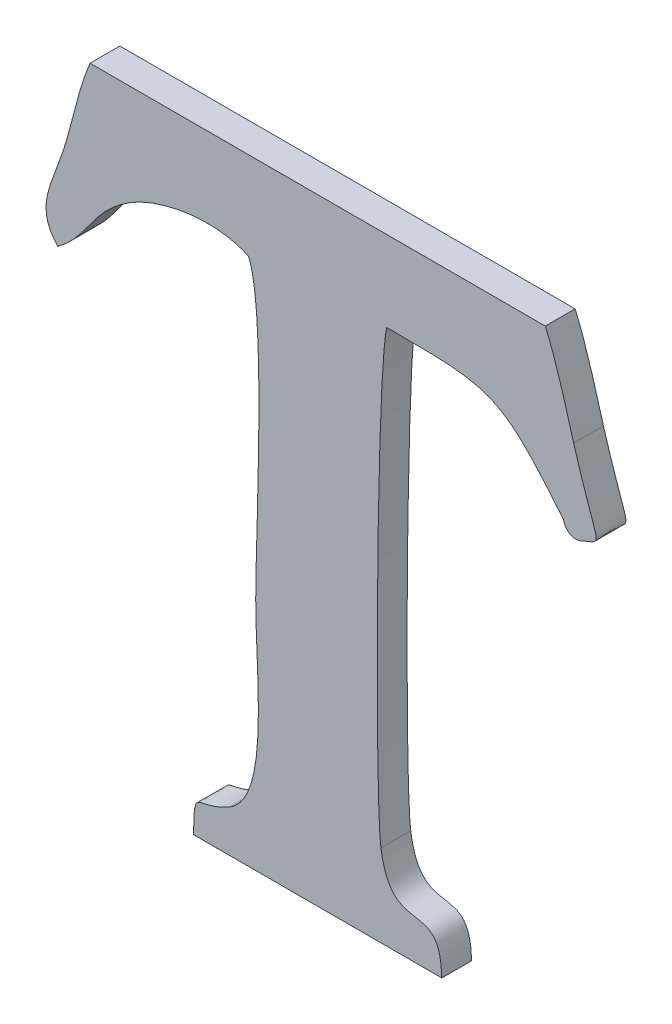
ISO-10303-21;
HEADER;
FILE_DESCRIPTION(('STEP AP214'),'2;1');
FILE_NAME('part.step','',(''),(''),'','','');
FILE_SCHEMA(('AUTOMOTIVE_DESIGN { 1 0 10303 214 1 1 1 1 }'));
ENDSEC;
DATA;
#1=APPLICATION_CONTEXT('core data for automotive mechanical design processes');
#2=APPLICATION_PROTOCOL_DEFINITION('international standard','automotive_design',2000,#1);
#3=PRODUCT_CONTEXT('',#1,'mechanical');
#4=PRODUCT('Part','Part','',(#3));
#5=PRODUCT_RELATED_PRODUCT_CATEGORY('part','',(#4));
#6=PRODUCT_DEFINITION_FORMATION('','',#4);
#7=PRODUCT_DEFINITION_CONTEXT('part definition',#1,'design');
#8=PRODUCT_DEFINITION('design','',#6,#7);
#9=PRODUCT_DEFINITION_SHAPE('','',#8);
#10=(LENGTH_UNIT() NAMED_UNIT(*) SI_UNIT(.MILLI.,.METRE.));
#11=(NAMED_UNIT(*) PLANE_ANGLE_UNIT() SI_UNIT($,.RADIAN.));
#12=(NAMED_UNIT(*) SI_UNIT($,.STERADIAN.) SOLID_ANGLE_UNIT());
#13=UNCERTAINTY_MEASURE_WITH_UNIT(LENGTH_MEASURE(1.E-05),#10,'distance_accuracy_value','');
#14=(GEOMETRIC_REPRESENTATION_CONTEXT(3) GLOBAL_UNCERTAINTY_ASSIGNED_CONTEXT((#13)) GLOBAL_UNIT_ASSIGNED_CONTEXT((#10,
#11,#12)) REPRESENTATION_CONTEXT('',''));
#15=CARTESIAN_POINT('',(0.,0.,0.));
#16=DIRECTION('',(0.,0.,1.));
#17=DIRECTION('',(1.,0.,0.));
#18=AXIS2_PLACEMENT_3D('',#15,#16,#17);
#19=CARTESIAN_POINT('',(50.1670499999998,11.219925,0.001));
#20=CARTESIAN_POINT('',(50.1670499999998,11.219925,0.));
#21=CARTESIAN_POINT('',(50.1666579999998,11.219015,0.001));
#22=CARTESIAN_POINT('',(50.1666579999998,11.219015,0.));
#23=CARTESIAN_POINT('',(50.1664759999998,11.217951,0.001));
#24=CARTESIAN_POINT('',(50.1664759999998,11.217951,0.));
#25=CARTESIAN_POINT('',(50.1661539999998,11.216943,0.001));
#26=CARTESIAN_POINT('',(50.1661539999998,11.216943,0.));
#27=B_SPLINE_SURFACE_WITH_KNOTS('',3,1,((#19,#20),(#21,#22),(#23,#24),(#25,#26)),.UNSPECIFIED.,
.F.,.F.,.F.,(4,4),(2,2),(0.8125,0.875),(0.,1.),.UNSPECIFIED.);
#28=CARTESIAN_POINT('',(50.1670499999998,11.219925,0.));
#29=CARTESIAN_POINT('',(50.1666579999998,11.219015,0.));
#30=CARTESIAN_POINT('',(50.1664759999998,11.217951,0.));
#31=CARTESIAN_POINT('',(50.1661539999998,11.216943,0.));
#32=B_SPLINE_CURVE_WITH_KNOTS('',3,(#28,#29,#30,#31),.UNSPECIFIED.,.F.,.F.,(4,4),(0.8125,0.875),.UNSPECIFIED.);
#33=CARTESIAN_POINT('',(50.1670499999998,11.219925,0.));
#34=VERTEX_POINT('',#33);
#35=CARTESIAN_POINT('',(50.1661539999998,11.216943,0.));
#36=VERTEX_POINT('',#35);
#37=EDGE_CURVE('E11',#34,#36,#32,.T.);
#38=DIRECTION('',(0.,0.,-1.));
#39=VECTOR('',#38,1.);
#40=CARTESIAN_POINT('',(50.1661539999998,11.216943,0.001));
#41=LINE('',#40,#39);
#42=CARTESIAN_POINT('',(50.1661539999998,11.216943,0.001));
#43=VERTEX_POINT('',#42);
#44=EDGE_CURVE('E28',#43,#36,#41,.T.);
#45=CARTESIAN_POINT('',(50.1670499999998,11.219925,0.001));
#46=CARTESIAN_POINT('',(50.1666579999998,11.219015,0.001));
#47=CARTESIAN_POINT('',(50.1664759999998,11.217951,0.001));
#48=CARTESIAN_POINT('',(50.1661539999998,11.216943,0.001));
#49=B_SPLINE_CURVE_WITH_KNOTS('',3,(#45,#46,#47,#48),.UNSPECIFIED.,.F.,.F.,(4,4),(0.8125,0.875),.UNSPECIFIED.);
#50=CARTESIAN_POINT('',(50.1670499999998,11.219925,0.001));
#51=VERTEX_POINT('',#50);
#52=EDGE_CURVE('E356',#51,#43,#49,.T.);
#53=DIRECTION('',(0.,0.,-1.));
#54=VECTOR('',#53,1.);
#55=CARTESIAN_POINT('',(50.1670499999998,11.219925,0.001));
#56=LINE('',#55,#54);
#57=EDGE_CURVE('E40',#51,#34,#56,.T.);
#58=ORIENTED_EDGE('',*,*,#37,.T.);
#59=ORIENTED_EDGE('',*,*,#44,.F.);
#60=ORIENTED_EDGE('',*,*,#52,.F.);
#61=ORIENTED_EDGE('',*,*,#57,.T.);
#62=EDGE_LOOP('',(#58,#59,#60,#61));
#63=FACE_BOUND('',#62,.T.);
#64=ADVANCED_FACE('F17',(#63),#27,.F.);
#65=CARTESIAN_POINT('',(50.1661539999998,11.216943,0.001));
#66=CARTESIAN_POINT('',(50.1661539999998,11.216943,0.));
#67=CARTESIAN_POINT('',(50.1657619999998,11.215753,0.001));
#68=CARTESIAN_POINT('',(50.1657619999998,11.215753,0.));
#69=CARTESIAN_POINT('',(50.1651739999998,11.214899,0.001));
#70=CARTESIAN_POINT('',(50.1651739999998,11.214899,0.));
#71=CARTESIAN_POINT('',(50.1659719999998,11.214059,0.001));
#72=CARTESIAN_POINT('',(50.1659719999998,11.214059,0.));
#73=B_SPLINE_SURFACE_WITH_KNOTS('',3,1,((#65,#66),(#67,#68),(#69,#70),(#71,#72)),.UNSPECIFIED.,
.F.,.F.,.F.,(4,4),(2,2),(0.875,1.),(0.,1.),.UNSPECIFIED.);
#74=CARTESIAN_POINT('',(50.1661539999998,11.216943,0.));
#75=CARTESIAN_POINT('',(50.1657619999998,11.215753,0.));
#76=CARTESIAN_POINT('',(50.1651739999998,11.214899,0.));
#77=CARTESIAN_POINT('',(50.1659719999998,11.214059,0.));
#78=B_SPLINE_CURVE_WITH_KNOTS('',3,(#74,#75,#76,#77),.UNSPECIFIED.,.F.,.F.,(4,4),(0.875,1.),.UNSPECIFIED.);
#79=CARTESIAN_POINT('',(50.1659719999998,11.214059,0.));
#80=VERTEX_POINT('',#79);
#81=EDGE_CURVE('E348',#36,#80,#78,.T.);
#82=DIRECTION('',(0.,0.,-1.));
#83=VECTOR('',#82,1.);
#84=CARTESIAN_POINT('',(50.1659719999998,11.214059,0.001));
#85=LINE('',#84,#83);
#86=CARTESIAN_POINT('',(50.1659719999998,11.214059,0.001));
#87=VERTEX_POINT('',#86);
#88=EDGE_CURVE('E343',#87,#80,#85,.T.);
#89=CARTESIAN_POINT('',(50.1661539999998,11.216943,0.001));
#90=CARTESIAN_POINT('',(50.1657619999998,11.215753,0.001));
#91=CARTESIAN_POINT('',(50.1651739999998,11.214899,0.001));
#92=CARTESIAN_POINT('',(50.1659719999998,11.214059,0.001));
#93=B_SPLINE_CURVE_WITH_KNOTS('',3,(#89,#90,#91,#92),.UNSPECIFIED.,.F.,.F.,(4,4),(0.875,1.),.UNSPECIFIED.);
#94=EDGE_CURVE('E336',#43,#87,#93,.T.);
#95=ORIENTED_EDGE('',*,*,#81,.T.);
#96=ORIENTED_EDGE('',*,*,#88,.F.);
#97=ORIENTED_EDGE('',*,*,#94,.F.);
#98=ORIENTED_EDGE('',*,*,#44,.T.);
#99=EDGE_LOOP('',(#95,#96,#97,#98));
#100=FACE_BOUND('',#99,.T.);
#101=ADVANCED_FACE('F364',(#100),#73,.F.);
#102=CARTESIAN_POINT('',(50.1659719999998,11.214059,0.001));
#103=CARTESIAN_POINT('',(50.1659719999998,11.214059,0.));
#104=CARTESIAN_POINT('',(50.1670639999998,11.214885,0.001));
#105=CARTESIAN_POINT('',(50.1670639999998,11.214885,0.));
#106=CARTESIAN_POINT('',(50.1670499999998,11.215697,0.001));
#107=CARTESIAN_POINT('',(50.1670499999998,11.215697,0.));
#108=CARTESIAN_POINT('',(50.1683799999998,11.216537,0.001));
#109=CARTESIAN_POINT('',(50.1683799999998,11.216537,0.));
#110=B_SPLINE_SURFACE_WITH_KNOTS('',3,1,((#102,#103),(#104,#105),(#106,#107),(#108,#109)),
.UNSPECIFIED.,.F.,.F.,.F.,(4,4),(2,2),(0.,0.0625),(0.,1.),.UNSPECIFIED.);
#111=CARTESIAN_POINT('',(50.1659719999998,11.214059,0.));
#112=CARTESIAN_POINT('',(50.1670639999998,11.214885,0.));
#113=CARTESIAN_POINT('',(50.1670499999998,11.215697,0.));
#114=CARTESIAN_POINT('',(50.1683799999998,11.216537,0.));
#115=B_SPLINE_CURVE_WITH_KNOTS('',3,(#111,#112,#113,#114),.UNSPECIFIED.,.F.,.F.,(4,4),(0.,
0.0625),.UNSPECIFIED.);
#116=CARTESIAN_POINT('',(50.1683799999998,11.216537,0.));
#117=VERTEX_POINT('',#116);
#118=EDGE_CURVE('E331',#80,#117,#115,.T.);
#119=DIRECTION('',(0.,0.,-1.));
#120=VECTOR('',#119,1.);
#121=CARTESIAN_POINT('',(50.1683799999998,11.216537,0.001));
#122=LINE('',#121,#120);
#123=CARTESIAN_POINT('',(50.1683799999998,11.216537,0.001));
#124=VERTEX_POINT('',#123);
#125=EDGE_CURVE('E326',#124,#117,#122,.T.);
#126=CARTESIAN_POINT('',(50.1659719999998,11.214059,0.001));
#127=CARTESIAN_POINT('',(50.1670639999998,11.214885,0.001));
#128=CARTESIAN_POINT('',(50.1670499999998,11.215697,0.001));
#129=CARTESIAN_POINT('',(50.1683799999998,11.216537,0.001));
#130=B_SPLINE_CURVE_WITH_KNOTS('',3,(#126,#127,#128,#129),.UNSPECIFIED.,.F.,.F.,(4,4),(0.,
0.0625),.UNSPECIFIED.);
#131=EDGE_CURVE('E319',#87,#124,#130,.T.);
#132=ORIENTED_EDGE('',*,*,#118,.T.);
#133=ORIENTED_EDGE('',*,*,#125,.F.);
#134=ORIENTED_EDGE('',*,*,#131,.F.);
#135=ORIENTED_EDGE('',*,*,#88,.T.);
#136=EDGE_LOOP('',(#132,#133,#134,#135));
#137=FACE_BOUND('',#136,.T.);
#138=ADVANCED_FACE('F369',(#137),#110,.F.);
#139=CARTESIAN_POINT('',(50.1683799999998,11.216537,0.001));
#140=CARTESIAN_POINT('',(50.1683799999998,11.216537,0.));
#141=CARTESIAN_POINT('',(50.1693879999998,11.217181,0.001));
#142=CARTESIAN_POINT('',(50.1693879999998,11.217181,0.));
#143=CARTESIAN_POINT('',(50.1712499999998,11.217517,0.001));
#144=CARTESIAN_POINT('',(50.1712499999998,11.217517,0.));
#145=CARTESIAN_POINT('',(50.1723699999998,11.216971,0.001));
#146=CARTESIAN_POINT('',(50.1723699999998,11.216971,0.));
#147=B_SPLINE_SURFACE_WITH_KNOTS('',3,1,((#139,#140),(#141,#142),(#143,#144),(#145,#146)),
.UNSPECIFIED.,.F.,.F.,.F.,(4,4),(2,2),(0.0625,0.125),(0.,1.),.UNSPECIFIED.);
#148=CARTESIAN_POINT('',(50.1683799999998,11.216537,0.));
#149=CARTESIAN_POINT('',(50.1693879999998,11.217181,0.));
#150=CARTESIAN_POINT('',(50.1712499999998,11.217517,0.));
#151=CARTESIAN_POINT('',(50.1723699999998,11.216971,0.));
#152=B_SPLINE_CURVE_WITH_KNOTS('',3,(#148,#149,#150,#151),.UNSPECIFIED.,.F.,.F.,(4,4),(0.0625,
0.125),.UNSPECIFIED.);
#153=CARTESIAN_POINT('',(50.1723699999998,11.216971,0.));
#154=VERTEX_POINT('',#153);
#155=EDGE_CURVE('E314',#117,#154,#152,.T.);
#156=DIRECTION('',(0.,0.,-1.));
#157=VECTOR('',#156,1.);
#158=CARTESIAN_POINT('',(50.1723699999998,11.216971,0.001));
#159=LINE('',#158,#157);
#160=CARTESIAN_POINT('',(50.1723699999998,11.216971,0.001));
#161=VERTEX_POINT('',#160);
#162=EDGE_CURVE('E309',#161,#154,#159,.T.);
#163=CARTESIAN_POINT('',(50.1683799999998,11.216537,0.001));
#164=CARTESIAN_POINT('',(50.1693879999998,11.217181,0.001));
#165=CARTESIAN_POINT('',(50.1712499999998,11.217517,0.001));
#166=CARTESIAN_POINT('',(50.1723699999998,11.216971,0.001));
#167=B_SPLINE_CURVE_WITH_KNOTS('',3,(#163,#164,#165,#166),.UNSPECIFIED.,.F.,.F.,(4,4),(0.0625,
0.125),.UNSPECIFIED.);
#168=EDGE_CURVE('E302',#124,#161,#167,.T.);
#169=ORIENTED_EDGE('',*,*,#155,.T.);
#170=ORIENTED_EDGE('',*,*,#162,.F.);
#171=ORIENTED_EDGE('',*,*,#168,.F.);
#172=ORIENTED_EDGE('',*,*,#125,.T.);
#173=EDGE_LOOP('',(#169,#170,#171,#172));
#174=FACE_BOUND('',#173,.T.);
#175=ADVANCED_FACE('F375',(#174),#147,.F.);
#176=CARTESIAN_POINT('',(50.1723699999998,11.216971,0.001));
#177=CARTESIAN_POINT('',(50.1723699999998,11.216971,0.));
#178=CARTESIAN_POINT('',(50.1729719999998,11.215585,0.001));
#179=CARTESIAN_POINT('',(50.1729719999998,11.215585,0.));
#180=CARTESIAN_POINT('',(50.1726079999998,11.209103,0.001));
#181=CARTESIAN_POINT('',(50.1726079999998,11.209103,0.));
#182=CARTESIAN_POINT('',(50.1726079999998,11.207129,0.001));
#183=CARTESIAN_POINT('',(50.1726079999998,11.207129,0.));
#184=B_SPLINE_SURFACE_WITH_KNOTS('',3,1,((#176,#177),(#178,#179),(#180,#181),(#182,#183)),
.UNSPECIFIED.,.F.,.F.,.F.,(4,4),(2,2),(0.125,0.1875),(0.,1.),.UNSPECIFIED.);
#185=CARTESIAN_POINT('',(50.1723699999998,11.216971,0.));
#186=CARTESIAN_POINT('',(50.1729719999998,11.215585,0.));
#187=CARTESIAN_POINT('',(50.1726079999998,11.209103,0.));
#188=CARTESIAN_POINT('',(50.1726079999998,11.207129,0.));
#189=B_SPLINE_CURVE_WITH_KNOTS('',3,(#185,#186,#187,#188),.UNSPECIFIED.,.F.,.F.,(4,4),(0.125,
0.1875),.UNSPECIFIED.);
#190=CARTESIAN_POINT('',(50.1726079999998,11.207129,0.));
#191=VERTEX_POINT('',#190);
#192=EDGE_CURVE('E297',#154,#191,#189,.T.);
#193=DIRECTION('',(0.,0.,-1.));
#194=VECTOR('',#193,1.);
#195=CARTESIAN_POINT('',(50.1726079999998,11.207129,0.001));
#196=LINE('',#195,#194);
#197=CARTESIAN_POINT('',(50.1726079999998,11.207129,0.001));
#198=VERTEX_POINT('',#197);
#199=EDGE_CURVE('E292',#198,#191,#196,.T.);
#200=CARTESIAN_POINT('',(50.1723699999998,11.216971,0.001));
#201=CARTESIAN_POINT('',(50.1729719999998,11.215585,0.001));
#202=CARTESIAN_POINT('',(50.1726079999998,11.209103,0.001));
#203=CARTESIAN_POINT('',(50.1726079999998,11.207129,0.001));
#204=B_SPLINE_CURVE_WITH_KNOTS('',3,(#200,#201,#202,#203),.UNSPECIFIED.,.F.,.F.,(4,4),(0.125,
0.1875),.UNSPECIFIED.);
#205=EDGE_CURVE('E285',#161,#198,#204,.T.);
#206=ORIENTED_EDGE('',*,*,#192,.T.);
#207=ORIENTED_EDGE('',*,*,#199,.F.);
#208=ORIENTED_EDGE('',*,*,#205,.F.);
#209=ORIENTED_EDGE('',*,*,#162,.T.);
#210=EDGE_LOOP('',(#206,#207,#208,#209));
#211=FACE_BOUND('',#210,.T.);
#212=ADVANCED_FACE('F379',(#211),#184,.F.);
#213=CARTESIAN_POINT('',(50.1726079999998,11.207129,0.001));
#214=CARTESIAN_POINT('',(50.1726079999998,11.207129,0.));
#215=CARTESIAN_POINT('',(50.1726079999998,11.204875,0.001));
#216=CARTESIAN_POINT('',(50.1726079999998,11.204875,0.));
#217=CARTESIAN_POINT('',(50.1731119999998,11.201487,0.001));
#218=CARTESIAN_POINT('',(50.1731119999998,11.201487,0.));
#219=CARTESIAN_POINT('',(50.1717399999998,11.200661,0.001));
#220=CARTESIAN_POINT('',(50.1717399999998,11.200661,0.));
#221=B_SPLINE_SURFACE_WITH_KNOTS('',3,1,((#213,#214),(#215,#216),(#217,#218),(#219,#220)),
.UNSPECIFIED.,.F.,.F.,.F.,(4,4),(2,2),(0.1875,0.25),(0.,1.),.UNSPECIFIED.);
#222=CARTESIAN_POINT('',(50.1726079999998,11.207129,0.));
#223=CARTESIAN_POINT('',(50.1726079999998,11.204875,0.));
#224=CARTESIAN_POINT('',(50.1731119999998,11.201487,0.));
#225=CARTESIAN_POINT('',(50.1717399999998,11.200661,0.));
#226=B_SPLINE_CURVE_WITH_KNOTS('',3,(#222,#223,#224,#225),.UNSPECIFIED.,.F.,.F.,(4,4),(0.1875,
0.25),.UNSPECIFIED.);
#227=CARTESIAN_POINT('',(50.1717399999998,11.200661,0.));
#228=VERTEX_POINT('',#227);
#229=EDGE_CURVE('E280',#191,#228,#226,.T.);
#230=DIRECTION('',(0.,0.,-1.));
#231=VECTOR('',#230,1.);
#232=CARTESIAN_POINT('',(50.1717399999998,11.200661,0.001));
#233=LINE('',#232,#231);
#234=CARTESIAN_POINT('',(50.1717399999998,11.200661,0.001));
#235=VERTEX_POINT('',#234);
#236=EDGE_CURVE('E275',#235,#228,#233,.T.);
#237=CARTESIAN_POINT('',(50.1726079999998,11.207129,0.001));
#238=CARTESIAN_POINT('',(50.1726079999998,11.204875,0.001));
#239=CARTESIAN_POINT('',(50.1731119999998,11.201487,0.001));
#240=CARTESIAN_POINT('',(50.1717399999998,11.200661,0.001));
#241=B_SPLINE_CURVE_WITH_KNOTS('',3,(#237,#238,#239,#240),.UNSPECIFIED.,.F.,.F.,(4,4),(0.1875,
0.25),.UNSPECIFIED.);
#242=EDGE_CURVE('E268',#198,#235,#241,.T.);
#243=ORIENTED_EDGE('',*,*,#229,.T.);
#244=ORIENTED_EDGE('',*,*,#236,.F.);
#245=ORIENTED_EDGE('',*,*,#242,.F.);
#246=ORIENTED_EDGE('',*,*,#199,.T.);
#247=EDGE_LOOP('',(#243,#244,#245,#246));
#248=FACE_BOUND('',#247,.T.);
#249=ADVANCED_FACE('F384',(#248),#221,.F.);
#250=CARTESIAN_POINT('',(50.1717399999998,11.200661,0.001));
#251=CARTESIAN_POINT('',(50.1717399999998,11.200661,0.));
#252=CARTESIAN_POINT('',(50.1705779999998,11.199975,0.001));
#253=CARTESIAN_POINT('',(50.1705779999998,11.199975,0.));
#254=CARTESIAN_POINT('',(50.1705499999998,11.200801,0.001));
#255=CARTESIAN_POINT('',(50.1705499999998,11.200801,0.));
#256=CARTESIAN_POINT('',(50.1705219999998,11.199247,0.001));
#257=CARTESIAN_POINT('',(50.1705219999998,11.199247,0.));
#258=B_SPLINE_SURFACE_WITH_KNOTS('',3,1,((#250,#251),(#252,#253),(#254,#255),(#256,#257)),
.UNSPECIFIED.,.F.,.F.,.F.,(4,4),(2,2),(0.25,0.3125),(0.,1.),.UNSPECIFIED.);
#259=CARTESIAN_POINT('',(50.1717399999998,11.200661,0.));
#260=CARTESIAN_POINT('',(50.1705779999998,11.199975,0.));
#261=CARTESIAN_POINT('',(50.1705499999998,11.200801,0.));
#262=CARTESIAN_POINT('',(50.1705219999998,11.199247,0.));
#263=B_SPLINE_CURVE_WITH_KNOTS('',3,(#259,#260,#261,#262),.UNSPECIFIED.,.F.,.F.,(4,4),(0.25,
0.3125),.UNSPECIFIED.);
#264=CARTESIAN_POINT('',(50.1705219999998,11.199247,0.));
#265=VERTEX_POINT('',#264);
#266=EDGE_CURVE('E263',#228,#265,#263,.T.);
#267=DIRECTION('',(0.,0.,-1.));
#268=VECTOR('',#267,1.);
#269=CARTESIAN_POINT('',(50.1705219999998,11.199247,0.001));
#270=LINE('',#269,#268);
#271=CARTESIAN_POINT('',(50.1705219999998,11.199247,0.001));
#272=VERTEX_POINT('',#271);
#273=EDGE_CURVE('E258',#272,#265,#270,.T.);
#274=CARTESIAN_POINT('',(50.1717399999998,11.200661,0.001));
#275=CARTESIAN_POINT('',(50.1705779999998,11.199975,0.001));
#276=CARTESIAN_POINT('',(50.1705499999998,11.200801,0.001));
#277=CARTESIAN_POINT('',(50.1705219999998,11.199247,0.001));
#278=B_SPLINE_CURVE_WITH_KNOTS('',3,(#274,#275,#276,#277),.UNSPECIFIED.,.F.,.F.,(4,4),(0.25,
0.3125),.UNSPECIFIED.);
#279=EDGE_CURVE('E254',#235,#272,#278,.T.);
#280=ORIENTED_EDGE('',*,*,#266,.T.);
#281=ORIENTED_EDGE('',*,*,#273,.F.);
#282=ORIENTED_EDGE('',*,*,#279,.F.);
#283=ORIENTED_EDGE('',*,*,#236,.T.);
#284=EDGE_LOOP('',(#280,#281,#282,#283));
#285=FACE_BOUND('',#284,.T.);
#286=ADVANCED_FACE('F390',(#285),#258,.F.);
#287=CARTESIAN_POINT('',(0.,11.199247,0.001));
#288=DIRECTION('',(0.,1.,0.));
#289=DIRECTION('',(0.,0.,1.));
#290=AXIS2_PLACEMENT_3D('',#287,#288,#289);
#291=PLANE('',#290);
#292=DIRECTION('',(1.,0.,0.));
#293=VECTOR('',#292,1.);
#294=CARTESIAN_POINT('',(0.,11.199247,0.));
#295=LINE('',#294,#293);
#296=CARTESIAN_POINT('',(50.1788519999998,11.199247,0.));
#297=VERTEX_POINT('',#296);
#298=EDGE_CURVE('E252',#265,#297,#295,.T.);
#299=ORIENTED_EDGE('',*,*,#298,.T.);
#300=DIRECTION('',(0.,0.,-1.));
#301=VECTOR('',#300,1.);
#302=CARTESIAN_POINT('',(50.1788519999998,11.199247,0.001));
#303=LINE('',#302,#301);
#304=CARTESIAN_POINT('',(50.1788519999998,11.199247,0.001));
#305=VERTEX_POINT('',#304);
#306=EDGE_CURVE('E249',#305,#297,#303,.T.);
#307=ORIENTED_EDGE('',*,*,#306,.F.);
#308=DIRECTION('',(1.,0.,0.));
#309=VECTOR('',#308,1.);
#310=CARTESIAN_POINT('',(0.,11.199247,0.001));
#311=LINE('',#310,#309);
#312=EDGE_CURVE('E243',#272,#305,#311,.T.);
#313=ORIENTED_EDGE('',*,*,#312,.F.);
#314=ORIENTED_EDGE('',*,*,#273,.T.);
#315=EDGE_LOOP('',(#299,#307,#313,#314));
#316=FACE_BOUND('',#315,.T.);
#317=ADVANCED_FACE('F394',(#316),#291,.F.);
#318=CARTESIAN_POINT('',(50.1788519999998,11.199247,0.001));
#319=CARTESIAN_POINT('',(50.1788519999998,11.199247,0.));
#320=CARTESIAN_POINT('',(50.1787959999998,11.201613,0.001));
#321=CARTESIAN_POINT('',(50.1787959999998,11.201613,0.));
#322=CARTESIAN_POINT('',(50.1771859999998,11.199499,0.001));
#323=CARTESIAN_POINT('',(50.1771859999998,11.199499,0.));
#324=CARTESIAN_POINT('',(50.1768079999998,11.202005,0.001));
#325=CARTESIAN_POINT('',(50.1768079999998,11.202005,0.));
#326=B_SPLINE_SURFACE_WITH_KNOTS('',3,1,((#318,#319),(#320,#321),(#322,#323),(#324,#325)),
.UNSPECIFIED.,.F.,.F.,.F.,(4,4),(2,2),(0.375,0.4375),(0.,1.),.UNSPECIFIED.);
#327=CARTESIAN_POINT('',(50.1788519999998,11.199247,0.));
#328=CARTESIAN_POINT('',(50.1787959999998,11.201613,0.));
#329=CARTESIAN_POINT('',(50.1771859999998,11.199499,0.));
#330=CARTESIAN_POINT('',(50.1768079999998,11.202005,0.));
#331=B_SPLINE_CURVE_WITH_KNOTS('',3,(#327,#328,#329,#330),.UNSPECIFIED.,.F.,.F.,(4,4),(0.375,
0.4375),.UNSPECIFIED.);
#332=CARTESIAN_POINT('',(50.1768079999998,11.202005,0.));
#333=VERTEX_POINT('',#332);
#334=EDGE_CURVE('E238',#297,#333,#331,.T.);
#335=DIRECTION('',(0.,0.,-1.));
#336=VECTOR('',#335,1.);
#337=CARTESIAN_POINT('',(50.1768079999998,11.202005,0.001));
#338=LINE('',#337,#336);
#339=CARTESIAN_POINT('',(50.1768079999998,11.202005,0.001));
#340=VERTEX_POINT('',#339);
#341=EDGE_CURVE('E233',#340,#333,#338,.T.);
#342=CARTESIAN_POINT('',(50.1788519999998,11.199247,0.001));
#343=CARTESIAN_POINT('',(50.1787959999998,11.201613,0.001));
#344=CARTESIAN_POINT('',(50.1771859999998,11.199499,0.001));
#345=CARTESIAN_POINT('',(50.1768079999998,11.202005,0.001));
#346=B_SPLINE_CURVE_WITH_KNOTS('',3,(#342,#343,#344,#345),.UNSPECIFIED.,.F.,.F.,(4,4),(0.375,
0.4375),.UNSPECIFIED.);
#347=EDGE_CURVE('E226',#305,#340,#346,.T.);
#348=ORIENTED_EDGE('',*,*,#334,.T.);
#349=ORIENTED_EDGE('',*,*,#341,.F.);
#350=ORIENTED_EDGE('',*,*,#347,.F.);
#351=ORIENTED_EDGE('',*,*,#306,.T.);
#352=EDGE_LOOP('',(#348,#349,#350,#351));
#353=FACE_BOUND('',#352,.T.);
#354=ADVANCED_FACE('F397',(#353),#326,.F.);
#355=CARTESIAN_POINT('',(50.1768079999998,11.202005,0.001));
#356=CARTESIAN_POINT('',(50.1768079999998,11.202005,0.));
#357=CARTESIAN_POINT('',(50.1765979999998,11.203433,0.001));
#358=CARTESIAN_POINT('',(50.1765979999998,11.203433,0.));
#359=CARTESIAN_POINT('',(50.1766539999998,11.215697,0.001));
#360=CARTESIAN_POINT('',(50.1766539999998,11.215697,0.));
#361=CARTESIAN_POINT('',(50.1770039999998,11.217223,0.001));
#362=CARTESIAN_POINT('',(50.1770039999998,11.217223,0.));
#363=B_SPLINE_SURFACE_WITH_KNOTS('',3,1,((#355,#356),(#357,#358),(#359,#360),(#361,#362)),
.UNSPECIFIED.,.F.,.F.,.F.,(4,4),(2,2),(0.4375,0.5),(0.,1.),.UNSPECIFIED.);
#364=CARTESIAN_POINT('',(50.1768079999998,11.202005,0.));
#365=CARTESIAN_POINT('',(50.1765979999998,11.203433,0.));
#366=CARTESIAN_POINT('',(50.1766539999998,11.215697,0.));
#367=CARTESIAN_POINT('',(50.1770039999998,11.217223,0.));
#368=B_SPLINE_CURVE_WITH_KNOTS('',3,(#364,#365,#366,#367),.UNSPECIFIED.,.F.,.F.,(4,4),(0.4375,
0.5),.UNSPECIFIED.);
#369=CARTESIAN_POINT('',(50.1770039999998,11.217223,0.));
#370=VERTEX_POINT('',#369);
#371=EDGE_CURVE('E221',#333,#370,#368,.T.);
#372=DIRECTION('',(0.,0.,-1.));
#373=VECTOR('',#372,1.);
#374=CARTESIAN_POINT('',(50.1770039999998,11.217223,0.001));
#375=LINE('',#374,#373);
#376=CARTESIAN_POINT('',(50.1770039999998,11.217223,0.001));
#377=VERTEX_POINT('',#376);
#378=EDGE_CURVE('E216',#377,#370,#375,.T.);
#379=CARTESIAN_POINT('',(50.1768079999998,11.202005,0.001));
#380=CARTESIAN_POINT('',(50.1765979999998,11.203433,0.001));
#381=CARTESIAN_POINT('',(50.1766539999998,11.215697,0.001));
#382=CARTESIAN_POINT('',(50.1770039999998,11.217223,0.001));
#383=B_SPLINE_CURVE_WITH_KNOTS('',3,(#379,#380,#381,#382),.UNSPECIFIED.,.F.,.F.,(4,4),(0.4375,
0.5),.UNSPECIFIED.);
#384=EDGE_CURVE('E209',#340,#377,#383,.T.);
#385=ORIENTED_EDGE('',*,*,#371,.T.);
#386=ORIENTED_EDGE('',*,*,#378,.F.);
#387=ORIENTED_EDGE('',*,*,#384,.F.);
#388=ORIENTED_EDGE('',*,*,#341,.T.);
#389=EDGE_LOOP('',(#385,#386,#387,#388));
#390=FACE_BOUND('',#389,.T.);
#391=ADVANCED_FACE('F406',(#390),#363,.F.);
#392=CARTESIAN_POINT('',(50.1770039999998,11.217223,0.001));
#393=CARTESIAN_POINT('',(50.1770039999998,11.217223,0.));
#394=CARTESIAN_POINT('',(50.1805599999998,11.217223,0.001));
#395=CARTESIAN_POINT('',(50.1805599999998,11.217223,0.));
#396=CARTESIAN_POINT('',(50.1807979999998,11.217209,0.001));
#397=CARTESIAN_POINT('',(50.1807979999998,11.217209,0.));
#398=CARTESIAN_POINT('',(50.1829259999998,11.214619,0.001));
#399=CARTESIAN_POINT('',(50.1829259999998,11.214619,0.));
#400=B_SPLINE_SURFACE_WITH_KNOTS('',3,1,((#392,#393),(#394,#395),(#396,#397),(#398,#399)),
.UNSPECIFIED.,.F.,.F.,.F.,(4,4),(2,2),(0.5,0.5625),(0.,1.),.UNSPECIFIED.);
#401=CARTESIAN_POINT('',(50.1770039999998,11.217223,0.));
#402=CARTESIAN_POINT('',(50.1805599999998,11.217223,0.));
#403=CARTESIAN_POINT('',(50.1807979999998,11.217209,0.));
#404=CARTESIAN_POINT('',(50.1829259999998,11.214619,0.));
#405=B_SPLINE_CURVE_WITH_KNOTS('',3,(#401,#402,#403,#404),.UNSPECIFIED.,.F.,.F.,(4,4),(0.5,
0.5625),.UNSPECIFIED.);
#406=CARTESIAN_POINT('',(50.1829259999998,11.214619,0.));
#407=VERTEX_POINT('',#406);
#408=EDGE_CURVE('E204',#370,#407,#405,.T.);
#409=DIRECTION('',(0.,0.,-1.));
#410=VECTOR('',#409,1.);
#411=CARTESIAN_POINT('',(50.1829259999998,11.214619,0.001));
#412=LINE('',#411,#410);
#413=CARTESIAN_POINT('',(50.1829259999998,11.214619,0.001));
#414=VERTEX_POINT('',#413);
#415=EDGE_CURVE('E199',#414,#407,#412,.T.);
#416=CARTESIAN_POINT('',(50.1770039999998,11.217223,0.001));
#417=CARTESIAN_POINT('',(50.1805599999998,11.217223,0.001));
#418=CARTESIAN_POINT('',(50.1807979999998,11.217209,0.001));
#419=CARTESIAN_POINT('',(50.1829259999998,11.214619,0.001));
#420=B_SPLINE_CURVE_WITH_KNOTS('',3,(#416,#417,#418,#419),.UNSPECIFIED.,.F.,.F.,(4,4),(0.5,
0.5625),.UNSPECIFIED.);
#421=EDGE_CURVE('E192',#377,#414,#420,.T.);
#422=ORIENTED_EDGE('',*,*,#408,.T.);
#423=ORIENTED_EDGE('',*,*,#415,.F.);
#424=ORIENTED_EDGE('',*,*,#421,.F.);
#425=ORIENTED_EDGE('',*,*,#378,.T.);
#426=EDGE_LOOP('',(#422,#423,#424,#425));
#427=FACE_BOUND('',#426,.T.);
#428=ADVANCED_FACE('F413',(#427),#400,.F.);
#429=CARTESIAN_POINT('',(50.1829259999998,11.214619,0.001));
#430=CARTESIAN_POINT('',(50.1829259999998,11.214619,0.));
#431=CARTESIAN_POINT('',(50.1830644441378,11.2141550305615,0.001));
#432=CARTESIAN_POINT('',(50.1830644441378,11.2141550305615,0.));
#433=CARTESIAN_POINT('',(50.1834859999998,11.214269,0.001));
#434=CARTESIAN_POINT('',(50.1834859999998,11.214269,0.));
#435=B_SPLINE_SURFACE_WITH_KNOTS('',2,1,((#429,#430),(#431,#432),(#433,#434)),.UNSPECIFIED.,.F.,
.F.,.F.,(3,3),(2,2),(0.,1.),(0.,1.),.UNSPECIFIED.);
#436=CARTESIAN_POINT('',(50.1829259999998,11.214619,0.));
#437=CARTESIAN_POINT('',(50.1830644441378,11.2141550305615,0.));
#438=CARTESIAN_POINT('',(50.1834859999998,11.214269,0.));
#439=B_SPLINE_CURVE_WITH_KNOTS('',2,(#436,#437,#438),.UNSPECIFIED.,.F.,.F.,(3,3),(0.,1.),.UNSPECIFIED.);
#440=CARTESIAN_POINT('',(50.1834859999998,11.214269,0.));
#441=VERTEX_POINT('',#440);
#442=EDGE_CURVE('E187',#407,#441,#439,.T.);
#443=DIRECTION('',(0.,0.,-1.));
#444=VECTOR('',#443,1.);
#445=CARTESIAN_POINT('',(50.1834859999998,11.214269,0.001));
#446=LINE('',#445,#444);
#447=CARTESIAN_POINT('',(50.1834859999998,11.214269,0.001));
#448=VERTEX_POINT('',#447);
#449=EDGE_CURVE('E182',#448,#441,#446,.T.);
#450=CARTESIAN_POINT('',(50.1829259999998,11.214619,0.001));
#451=CARTESIAN_POINT('',(50.1830644441378,11.2141550305615,0.001));
#452=CARTESIAN_POINT('',(50.1834859999998,11.214269,0.001));
#453=B_SPLINE_CURVE_WITH_KNOTS('',2,(#450,#451,#452),.UNSPECIFIED.,.F.,.F.,(3,3),(0.,1.),.UNSPECIFIED.);
#454=EDGE_CURVE('E175',#414,#448,#453,.T.);
#455=ORIENTED_EDGE('',*,*,#442,.T.);
#456=ORIENTED_EDGE('',*,*,#449,.F.);
#457=ORIENTED_EDGE('',*,*,#454,.F.);
#458=ORIENTED_EDGE('',*,*,#415,.T.);
#459=EDGE_LOOP('',(#455,#456,#457,#458));
#460=FACE_BOUND('',#459,.T.);
#461=ADVANCED_FACE('F415',(#460),#435,.F.);
#462=CARTESIAN_POINT('',(50.1834859999998,11.214269,0.001));
#463=CARTESIAN_POINT('',(50.1834859999998,11.214269,0.));
#464=CARTESIAN_POINT('',(50.1843539999998,11.214661,0.001));
#465=CARTESIAN_POINT('',(50.1843539999998,11.214661,0.));
#466=CARTESIAN_POINT('',(50.1841019999998,11.214171,0.001));
#467=CARTESIAN_POINT('',(50.1841019999998,11.214171,0.));
#468=CARTESIAN_POINT('',(50.1832759999998,11.216999,0.001));
#469=CARTESIAN_POINT('',(50.1832759999998,11.216999,0.));
#470=B_SPLINE_SURFACE_WITH_KNOTS('',3,1,((#462,#463),(#464,#465),(#466,#467),(#468,#469)),
.UNSPECIFIED.,.F.,.F.,.F.,(4,4),(2,2),(0.625,0.6875),(0.,1.),.UNSPECIFIED.);
#471=CARTESIAN_POINT('',(50.1834859999998,11.214269,0.));
#472=CARTESIAN_POINT('',(50.1843539999998,11.214661,0.));
#473=CARTESIAN_POINT('',(50.1841019999998,11.214171,0.));
#474=CARTESIAN_POINT('',(50.1832759999998,11.216999,0.));
#475=B_SPLINE_CURVE_WITH_KNOTS('',3,(#471,#472,#473,#474),.UNSPECIFIED.,.F.,.F.,(4,4),(0.625,
0.6875),.UNSPECIFIED.);
#476=CARTESIAN_POINT('',(50.1832759999998,11.216999,0.));
#477=VERTEX_POINT('',#476);
#478=EDGE_CURVE('E170',#441,#477,#475,.T.);
#479=DIRECTION('',(0.,0.,-1.));
#480=VECTOR('',#479,1.);
#481=CARTESIAN_POINT('',(50.1832759999998,11.216999,0.001));
#482=LINE('',#481,#480);
#483=CARTESIAN_POINT('',(50.1832759999998,11.216999,0.001));
#484=VERTEX_POINT('',#483);
#485=EDGE_CURVE('E165',#484,#477,#482,.T.);
#486=CARTESIAN_POINT('',(50.1834859999998,11.214269,0.001));
#487=CARTESIAN_POINT('',(50.1843539999998,11.214661,0.001));
#488=CARTESIAN_POINT('',(50.1841019999998,11.214171,0.001));
#489=CARTESIAN_POINT('',(50.1832759999998,11.216999,0.001));
#490=B_SPLINE_CURVE_WITH_KNOTS('',3,(#486,#487,#488,#489),.UNSPECIFIED.,.F.,.F.,(4,4),(0.625,
0.6875),.UNSPECIFIED.);
#491=EDGE_CURVE('E133',#448,#484,#490,.T.);
#492=ORIENTED_EDGE('',*,*,#478,.T.);
#493=ORIENTED_EDGE('',*,*,#485,.F.);
#494=ORIENTED_EDGE('',*,*,#491,.F.);
#495=ORIENTED_EDGE('',*,*,#449,.T.);
#496=EDGE_LOOP('',(#492,#493,#494,#495));
#497=FACE_BOUND('',#496,.T.);
#498=ADVANCED_FACE('F418',(#497),#470,.F.);
#499=CARTESIAN_POINT('',(50.1832759999998,11.216999,0.001));
#500=CARTESIAN_POINT('',(50.1832759999998,11.216999,0.));
#501=CARTESIAN_POINT('',(50.1830239999998,11.217895,0.001));
#502=CARTESIAN_POINT('',(50.1830239999998,11.217895,0.));
#503=CARTESIAN_POINT('',(50.1826879999998,11.219099,0.001));
#504=CARTESIAN_POINT('',(50.1826879999998,11.219099,0.));
#505=CARTESIAN_POINT('',(50.1823239999998,11.219925,0.001));
#506=CARTESIAN_POINT('',(50.1823239999998,11.219925,0.));
#507=B_SPLINE_SURFACE_WITH_KNOTS('',3,1,((#499,#500),(#501,#502),(#503,#504),(#505,#506)),
.UNSPECIFIED.,.F.,.F.,.F.,(4,4),(2,2),(0.6875,0.75),(0.,1.),.UNSPECIFIED.);
#508=CARTESIAN_POINT('',(50.1832759999998,11.216999,0.));
#509=CARTESIAN_POINT('',(50.1830239999998,11.217895,0.));
#510=CARTESIAN_POINT('',(50.1826879999998,11.219099,0.));
#511=CARTESIAN_POINT('',(50.1823239999998,11.219925,0.));
#512=B_SPLINE_CURVE_WITH_KNOTS('',3,(#508,#509,#510,#511),.UNSPECIFIED.,.F.,.F.,(4,4),(0.6875,
0.75),.UNSPECIFIED.);
#513=CARTESIAN_POINT('',(50.1823239999998,11.219925,0.));
#514=VERTEX_POINT('',#513);
#515=EDGE_CURVE('E142',#477,#514,#512,.T.);
#516=DIRECTION('',(0.,0.,-1.));
#517=VECTOR('',#516,1.);
#518=CARTESIAN_POINT('',(50.1823239999998,11.219925,0.001));
#519=LINE('',#518,#517);
#520=CARTESIAN_POINT('',(50.1823239999998,11.219925,0.001));
#521=VERTEX_POINT('',#520);
#522=EDGE_CURVE('E136',#521,#514,#519,.T.);
#523=CARTESIAN_POINT('',(50.1832759999998,11.216999,0.001));
#524=CARTESIAN_POINT('',(50.1830239999998,11.217895,0.001));
#525=CARTESIAN_POINT('',(50.1826879999998,11.219099,0.001));
#526=CARTESIAN_POINT('',(50.1823239999998,11.219925,0.001));
#527=B_SPLINE_CURVE_WITH_KNOTS('',3,(#523,#524,#525,#526),.UNSPECIFIED.,.F.,.F.,(4,4),(0.6875,
0.75),.UNSPECIFIED.);
#528=EDGE_CURVE('E127',#484,#521,#527,.T.);
#529=ORIENTED_EDGE('',*,*,#515,.T.);
#530=ORIENTED_EDGE('',*,*,#522,.F.);
#531=ORIENTED_EDGE('',*,*,#528,.F.);
#532=ORIENTED_EDGE('',*,*,#485,.T.);
#533=EDGE_LOOP('',(#529,#530,#531,#532));
#534=FACE_BOUND('',#533,.T.);
#535=ADVANCED_FACE('F140',(#534),#507,.F.);
#536=CARTESIAN_POINT('',(0.,11.219925,0.001));
#537=DIRECTION('',(0.,-1.,0.));
#538=DIRECTION('',(0.,0.,-1.));
#539=AXIS2_PLACEMENT_3D('',#536,#537,#538);
#540=PLANE('',#539);
#541=DIRECTION('',(-1.,0.,0.));
#542=VECTOR('',#541,1.);
#543=CARTESIAN_POINT('',(0.,11.219925,0.));
#544=LINE('',#543,#542);
#545=EDGE_CURVE('E137',#514,#34,#544,.T.);
#546=ORIENTED_EDGE('',*,*,#545,.T.);
#547=ORIENTED_EDGE('',*,*,#57,.F.);
#548=DIRECTION('',(-1.,0.,0.));
#549=VECTOR('',#548,1.);
#550=CARTESIAN_POINT('',(0.,11.219925,0.001));
#551=LINE('',#550,#549);
#552=EDGE_CURVE('E131',#521,#51,#551,.T.);
#553=ORIENTED_EDGE('',*,*,#552,.F.);
#554=ORIENTED_EDGE('',*,*,#522,.T.);
#555=EDGE_LOOP('',(#546,#547,#553,#554));
#556=FACE_BOUND('',#555,.T.);
#557=ADVANCED_FACE('F147',(#556),#540,.F.);
#558=CARTESIAN_POINT('',(0.,0.,0.001));
#559=DIRECTION('',(0.,0.,1.));
#560=DIRECTION('',(1.,0.,0.));
#561=AXIS2_PLACEMENT_3D('',#558,#559,#560);
#562=PLANE('',#561);
#563=ORIENTED_EDGE('',*,*,#52,.T.);
#564=ORIENTED_EDGE('',*,*,#94,.T.);
#565=ORIENTED_EDGE('',*,*,#131,.T.);
#566=ORIENTED_EDGE('',*,*,#168,.T.);
#567=ORIENTED_EDGE('',*,*,#205,.T.);
#568=ORIENTED_EDGE('',*,*,#242,.T.);
#569=ORIENTED_EDGE('',*,*,#279,.T.);
#570=ORIENTED_EDGE('',*,*,#312,.T.);
#571=ORIENTED_EDGE('',*,*,#347,.T.);
#572=ORIENTED_EDGE('',*,*,#384,.T.);
#573=ORIENTED_EDGE('',*,*,#421,.T.);
#574=ORIENTED_EDGE('',*,*,#454,.T.);
#575=ORIENTED_EDGE('',*,*,#491,.T.);
#576=ORIENTED_EDGE('',*,*,#528,.T.);
#577=ORIENTED_EDGE('',*,*,#552,.T.);
#578=EDGE_LOOP('',(#563,#564,#565,#566,#567,#568,#569,#570,#571,#572,#573,#574,#575,#576,#577));
#579=FACE_BOUND('',#578,.T.);
#580=ADVANCED_FACE('F129',(#579),#562,.T.);
#581=CARTESIAN_POINT('',(0.,0.,0.));
#582=DIRECTION('',(0.,0.,1.));
#583=DIRECTION('',(1.,0.,0.));
#584=AXIS2_PLACEMENT_3D('',#581,#582,#583);
#585=PLANE('',#584);
#586=ORIENTED_EDGE('',*,*,#37,.F.);
#587=ORIENTED_EDGE('',*,*,#545,.F.);
#588=ORIENTED_EDGE('',*,*,#515,.F.);
#589=ORIENTED_EDGE('',*,*,#478,.F.);
#590=ORIENTED_EDGE('',*,*,#442,.F.);
#591=ORIENTED_EDGE('',*,*,#408,.F.);
#592=ORIENTED_EDGE('',*,*,#371,.F.);
#593=ORIENTED_EDGE('',*,*,#334,.F.);
#594=ORIENTED_EDGE('',*,*,#298,.F.);
#595=ORIENTED_EDGE('',*,*,#266,.F.);
#596=ORIENTED_EDGE('',*,*,#229,.F.);
#597=ORIENTED_EDGE('',*,*,#192,.F.);
#598=ORIENTED_EDGE('',*,*,#155,.F.);
#599=ORIENTED_EDGE('',*,*,#118,.F.);
#600=ORIENTED_EDGE('',*,*,#81,.F.);
#601=EDGE_LOOP('',(#586,#587,#588,#589,#590,#591,#592,#593,#594,#595,#596,#597,#598,#599,#600));
#602=FACE_BOUND('',#601,.T.);
#603=ADVANCED_FACE('F401',(#602),#585,.F.);
#604=CLOSED_SHELL('',(#64,#101,#138,#175,#212,#249,#286,#317,#354,#391,#428,#461,#498,#535,#557,
#580,#603));
#605=MANIFOLD_SOLID_BREP('B1',#604);
#606=ADVANCED_BREP_SHAPE_REPRESENTATION('',(#18,#605),#14);
#607=SHAPE_DEFINITION_REPRESENTATION(#9,#606);
ENDSEC;
END-ISO-10303-21;
